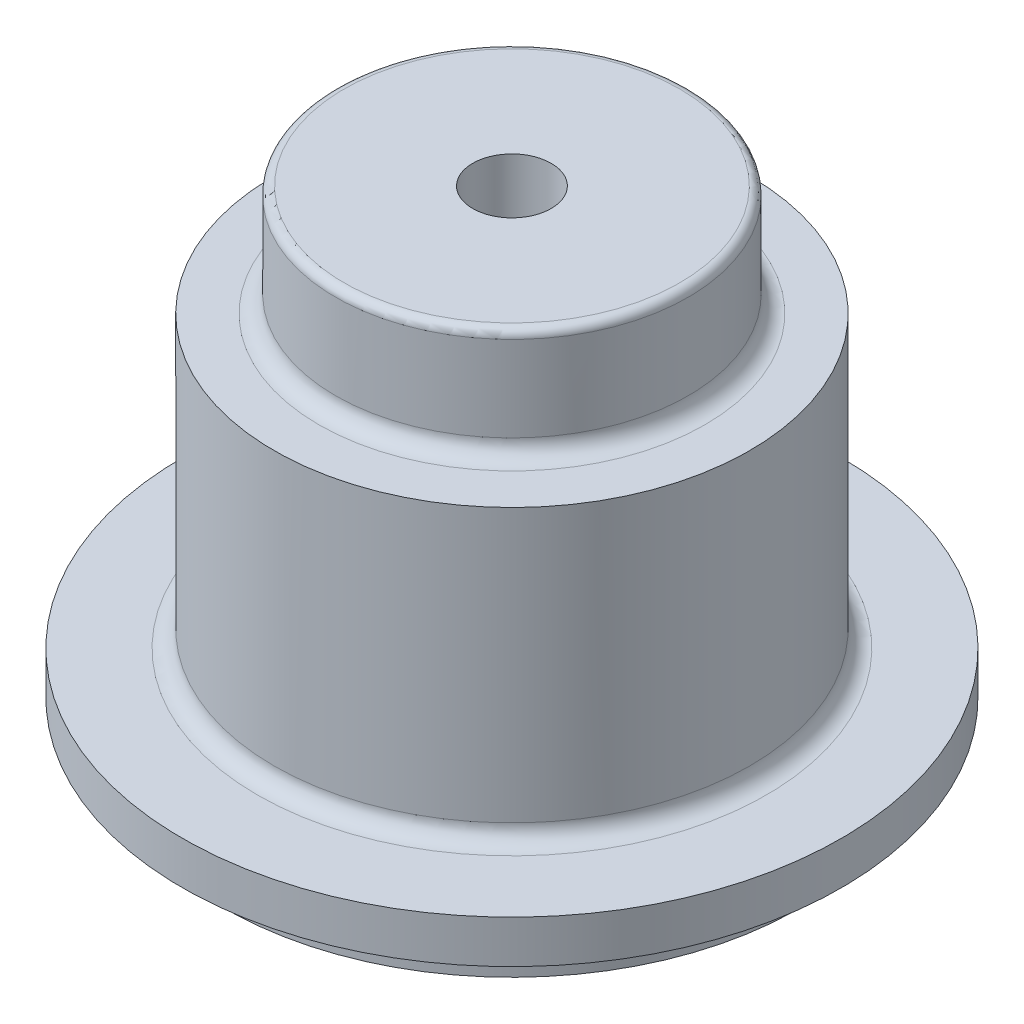
ISO-10303-21;
HEADER;
FILE_DESCRIPTION(('STEP AP214'),'2;1');
FILE_NAME('part.step','',(''),(''),'','','');
FILE_SCHEMA(('AUTOMOTIVE_DESIGN { 1 0 10303 214 1 1 1 1 }'));
ENDSEC;
DATA;
#1=APPLICATION_CONTEXT('core data for automotive mechanical design processes');
#2=APPLICATION_PROTOCOL_DEFINITION('international standard','automotive_design',2000,#1);
#3=PRODUCT_CONTEXT('',#1,'mechanical');
#4=PRODUCT('Part','Part','',(#3));
#5=PRODUCT_RELATED_PRODUCT_CATEGORY('part','',(#4));
#6=PRODUCT_DEFINITION_FORMATION('','',#4);
#7=PRODUCT_DEFINITION_CONTEXT('part definition',#1,'design');
#8=PRODUCT_DEFINITION('design','',#6,#7);
#9=PRODUCT_DEFINITION_SHAPE('','',#8);
#10=(LENGTH_UNIT() NAMED_UNIT(*) SI_UNIT(.MILLI.,.METRE.));
#11=(NAMED_UNIT(*) PLANE_ANGLE_UNIT() SI_UNIT($,.RADIAN.));
#12=(NAMED_UNIT(*) SI_UNIT($,.STERADIAN.) SOLID_ANGLE_UNIT());
#13=UNCERTAINTY_MEASURE_WITH_UNIT(LENGTH_MEASURE(1.E-05),#10,'distance_accuracy_value','');
#14=(GEOMETRIC_REPRESENTATION_CONTEXT(3) GLOBAL_UNCERTAINTY_ASSIGNED_CONTEXT((#13)) GLOBAL_UNIT_ASSIGNED_CONTEXT((#10,
#11,#12)) REPRESENTATION_CONTEXT('',''));
#15=CARTESIAN_POINT('',(0.,0.,0.));
#16=DIRECTION('',(0.,0.,1.));
#17=DIRECTION('',(1.,0.,0.));
#18=AXIS2_PLACEMENT_3D('',#15,#16,#17);
#19=CARTESIAN_POINT('',(0.,25.3,0.));
#20=DIRECTION('',(0.,1.,0.));
#21=DIRECTION('',(0.,0.,1.));
#22=AXIS2_PLACEMENT_3D('',#19,#20,#21);
#23=PLANE('',#22);
#24=CARTESIAN_POINT('',(0.,25.3,0.));
#25=DIRECTION('',(0.,-1.,0.));
#26=DIRECTION('',(0.,0.,-1.));
#27=AXIS2_PLACEMENT_3D('',#24,#25,#26);
#28=CIRCLE('',#27,12.3346398960364);
#29=CARTESIAN_POINT('',(0.,25.3,-12.3346398960364));
#30=VERTEX_POINT('',#29);
#31=EDGE_CURVE('E71',#30,#30,#28,.T.);
#32=ORIENTED_EDGE('',*,*,#31,.T.);
#33=EDGE_LOOP('',(#32));
#34=FACE_BOUND('',#33,.T.);
#35=ADVANCED_FACE('F39',(#34),#23,.F.);
#36=CARTESIAN_POINT('',(0.,0.,0.));
#37=DIRECTION('',(0.,-1.,0.));
#38=DIRECTION('',(0.,0.,-1.));
#39=AXIS2_PLACEMENT_3D('',#36,#37,#38);
#40=CYLINDRICAL_SURFACE('',#39,12.3346398960364);
#41=ORIENTED_EDGE('',*,*,#31,.F.);
#42=EDGE_LOOP('',(#41));
#43=FACE_BOUND('',#42,.T.);
#44=CARTESIAN_POINT('',(0.,0.,0.));
#45=DIRECTION('',(0.,-1.,0.));
#46=DIRECTION('',(0.,0.,-1.));
#47=AXIS2_PLACEMENT_3D('',#44,#45,#46);
#48=CIRCLE('',#47,12.3346398960364);
#49=CARTESIAN_POINT('',(0.,0.,-12.3346398960364));
#50=VERTEX_POINT('',#49);
#51=EDGE_CURVE('E75',#50,#50,#48,.T.);
#52=ORIENTED_EDGE('',*,*,#51,.T.);
#53=EDGE_LOOP('',(#52));
#54=FACE_BOUND('',#53,.T.);
#55=ADVANCED_FACE('F125',(#43,#54),#40,.F.);
#56=CARTESIAN_POINT('',(0.,0.,0.));
#57=DIRECTION('',(0.,-1.,0.));
#58=DIRECTION('',(0.,0.,-1.));
#59=AXIS2_PLACEMENT_3D('',#56,#57,#58);
#60=PLANE('',#59);
#61=CARTESIAN_POINT('',(0.,0.,0.));
#62=DIRECTION('',(0.,-1.,0.));
#63=DIRECTION('',(0.,0.,-1.));
#64=AXIS2_PLACEMENT_3D('',#61,#62,#63);
#65=CIRCLE('',#64,21.75);
#66=CARTESIAN_POINT('',(0.,0.,-21.75));
#67=VERTEX_POINT('',#66);
#68=EDGE_CURVE('E79',#67,#67,#65,.T.);
#69=ORIENTED_EDGE('',*,*,#68,.T.);
#70=EDGE_LOOP('',(#69));
#71=FACE_BOUND('',#70,.T.);
#72=ORIENTED_EDGE('',*,*,#51,.F.);
#73=EDGE_LOOP('',(#72));
#74=FACE_BOUND('',#73,.T.);
#75=ADVANCED_FACE('F131',(#71,#74),#60,.T.);
#76=CARTESIAN_POINT('',(0.,0.,0.));
#77=DIRECTION('',(0.,-1.,0.));
#78=DIRECTION('',(0.,0.,-1.));
#79=AXIS2_PLACEMENT_3D('',#76,#77,#78);
#80=CYLINDRICAL_SURFACE('',#79,21.75);
#81=CARTESIAN_POINT('',(0.,3.,0.));
#82=DIRECTION('',(0.,-1.,0.));
#83=DIRECTION('',(0.,0.,-1.));
#84=AXIS2_PLACEMENT_3D('',#81,#82,#83);
#85=CIRCLE('',#84,21.75);
#86=CARTESIAN_POINT('',(0.,3.,-21.75));
#87=VERTEX_POINT('',#86);
#88=EDGE_CURVE('E83',#87,#87,#85,.T.);
#89=ORIENTED_EDGE('',*,*,#88,.T.);
#90=EDGE_LOOP('',(#89));
#91=FACE_BOUND('',#90,.T.);
#92=ORIENTED_EDGE('',*,*,#68,.F.);
#93=EDGE_LOOP('',(#92));
#94=FACE_BOUND('',#93,.T.);
#95=ADVANCED_FACE('F171',(#91,#94),#80,.T.);
#96=CARTESIAN_POINT('',(0.,3.,0.));
#97=DIRECTION('',(0.,-1.,0.));
#98=DIRECTION('',(0.,0.,-1.));
#99=AXIS2_PLACEMENT_3D('',#96,#97,#98);
#100=PLANE('',#99);
#101=CARTESIAN_POINT('',(0.,3.,0.));
#102=DIRECTION('',(0.,-1.,0.));
#103=DIRECTION('',(0.,0.,-1.));
#104=AXIS2_PLACEMENT_3D('',#101,#102,#103);
#105=CIRCLE('',#104,25.);
#106=CARTESIAN_POINT('',(0.,3.,-25.));
#107=VERTEX_POINT('',#106);
#108=EDGE_CURVE('E87',#107,#107,#105,.T.);
#109=ORIENTED_EDGE('',*,*,#108,.T.);
#110=EDGE_LOOP('',(#109));
#111=FACE_BOUND('',#110,.T.);
#112=ORIENTED_EDGE('',*,*,#88,.F.);
#113=EDGE_LOOP('',(#112));
#114=FACE_BOUND('',#113,.T.);
#115=ADVANCED_FACE('F167',(#111,#114),#100,.T.);
#116=CARTESIAN_POINT('',(0.,0.,0.));
#117=DIRECTION('',(0.,-1.,0.));
#118=DIRECTION('',(0.,0.,-1.));
#119=AXIS2_PLACEMENT_3D('',#116,#117,#118);
#120=CYLINDRICAL_SURFACE('',#119,25.);
#121=CARTESIAN_POINT('',(0.,6.25,0.));
#122=DIRECTION('',(0.,-1.,0.));
#123=DIRECTION('',(0.,0.,-1.));
#124=AXIS2_PLACEMENT_3D('',#121,#122,#123);
#125=CIRCLE('',#124,25.);
#126=CARTESIAN_POINT('',(0.,6.25,-25.));
#127=VERTEX_POINT('',#126);
#128=EDGE_CURVE('E91',#127,#127,#125,.T.);
#129=ORIENTED_EDGE('',*,*,#128,.T.);
#130=EDGE_LOOP('',(#129));
#131=FACE_BOUND('',#130,.T.);
#132=ORIENTED_EDGE('',*,*,#108,.F.);
#133=EDGE_LOOP('',(#132));
#134=FACE_BOUND('',#133,.T.);
#135=ADVANCED_FACE('F160',(#131,#134),#120,.T.);
#136=CARTESIAN_POINT('',(0.,6.25,0.));
#137=DIRECTION('',(0.,1.,0.));
#138=DIRECTION('',(0.,0.,1.));
#139=AXIS2_PLACEMENT_3D('',#136,#137,#138);
#140=PLANE('',#139);
#141=CARTESIAN_POINT('',(0.,6.25,0.));
#142=DIRECTION('',(0.,1.,0.));
#143=DIRECTION('',(0.,0.,1.));
#144=AXIS2_PLACEMENT_3D('',#141,#142,#143);
#145=CIRCLE('',#144,19.3056104827136);
#146=CARTESIAN_POINT('',(0.,6.25,19.3056104827136));
#147=VERTEX_POINT('',#146);
#148=EDGE_CURVE('E67',#147,#147,#145,.F.);
#149=ORIENTED_EDGE('',*,*,#148,.T.);
#150=EDGE_LOOP('',(#149));
#151=FACE_BOUND('',#150,.T.);
#152=ORIENTED_EDGE('',*,*,#128,.F.);
#153=EDGE_LOOP('',(#152));
#154=FACE_BOUND('',#153,.T.);
#155=ADVANCED_FACE('F154',(#151,#154),#140,.T.);
#156=CARTESIAN_POINT('',(0.,0.,0.));
#157=DIRECTION('',(0.,-1.,0.));
#158=DIRECTION('',(0.,0.,-1.));
#159=AXIS2_PLACEMENT_3D('',#156,#157,#158);
#160=CYLINDRICAL_SURFACE('',#159,18.0356104827136);
#161=CARTESIAN_POINT('',(0.,7.52,0.));
#162=DIRECTION('',(0.,1.,0.));
#163=DIRECTION('',(0.,0.,1.));
#164=AXIS2_PLACEMENT_3D('',#161,#162,#163);
#165=CIRCLE('',#164,18.0356104827136);
#166=CARTESIAN_POINT('',(0.,7.52,18.0356104827136));
#167=VERTEX_POINT('',#166);
#168=EDGE_CURVE('E63',#167,#167,#165,.T.);
#169=ORIENTED_EDGE('',*,*,#168,.T.);
#170=EDGE_LOOP('',(#169));
#171=FACE_BOUND('',#170,.T.);
#172=CARTESIAN_POINT('',(0.,28.2358712803989,0.));
#173=DIRECTION('',(0.,-1.,0.));
#174=DIRECTION('',(0.,0.,-1.));
#175=AXIS2_PLACEMENT_3D('',#172,#173,#174);
#176=CIRCLE('',#175,18.0356104827136);
#177=CARTESIAN_POINT('',(0.,28.2358712803989,-18.0356104827136));
#178=VERTEX_POINT('',#177);
#179=EDGE_CURVE('E95',#178,#178,#176,.T.);
#180=ORIENTED_EDGE('',*,*,#179,.T.);
#181=EDGE_LOOP('',(#180));
#182=FACE_BOUND('',#181,.T.);
#183=ADVANCED_FACE('F149',(#171,#182),#160,.T.);
#184=CARTESIAN_POINT('',(0.,28.2358712803989,0.));
#185=DIRECTION('',(0.,1.,0.));
#186=DIRECTION('',(0.,0.,1.));
#187=AXIS2_PLACEMENT_3D('',#184,#185,#186);
#188=PLANE('',#187);
#189=CARTESIAN_POINT('',(0.,28.2358712803989,0.));
#190=DIRECTION('',(0.,1.,0.));
#191=DIRECTION('',(0.,0.,1.));
#192=AXIS2_PLACEMENT_3D('',#189,#190,#191);
#193=CIRCLE('',#192,14.640385965295);
#194=CARTESIAN_POINT('',(0.,28.2358712803989,14.640385965295));
#195=VERTEX_POINT('',#194);
#196=EDGE_CURVE('E57',#195,#195,#193,.F.);
#197=ORIENTED_EDGE('',*,*,#196,.T.);
#198=EDGE_LOOP('',(#197));
#199=FACE_BOUND('',#198,.T.);
#200=ORIENTED_EDGE('',*,*,#179,.F.);
#201=EDGE_LOOP('',(#200));
#202=FACE_BOUND('',#201,.T.);
#203=ADVANCED_FACE('F145',(#199,#202),#188,.T.);
#204=CARTESIAN_POINT('',(0.,0.,0.));
#205=DIRECTION('',(0.,-1.,0.));
#206=DIRECTION('',(0.,0.,-1.));
#207=AXIS2_PLACEMENT_3D('',#204,#205,#206);
#208=CYLINDRICAL_SURFACE('',#207,13.370385965295);
#209=CARTESIAN_POINT('',(0.,35.9760951977092,0.));
#210=DIRECTION('',(0.,-1.,0.));
#211=DIRECTION('',(0.,0.,-1.));
#212=AXIS2_PLACEMENT_3D('',#209,#210,#211);
#213=CIRCLE('',#212,13.370385965295);
#214=CARTESIAN_POINT('',(0.,35.9760951977092,-13.370385965295));
#215=VERTEX_POINT('',#214);
#216=EDGE_CURVE('E47',#215,#215,#213,.T.);
#217=ORIENTED_EDGE('',*,*,#216,.T.);
#218=EDGE_LOOP('',(#217));
#219=FACE_BOUND('',#218,.T.);
#220=CARTESIAN_POINT('',(0.,29.5058712803989,0.));
#221=DIRECTION('',(0.,1.,0.));
#222=DIRECTION('',(0.,0.,1.));
#223=AXIS2_PLACEMENT_3D('',#220,#221,#222);
#224=CIRCLE('',#223,13.370385965295);
#225=CARTESIAN_POINT('',(0.,29.5058712803989,13.370385965295));
#226=VERTEX_POINT('',#225);
#227=EDGE_CURVE('E52',#226,#226,#224,.T.);
#228=ORIENTED_EDGE('',*,*,#227,.T.);
#229=EDGE_LOOP('',(#228));
#230=FACE_BOUND('',#229,.T.);
#231=ADVANCED_FACE('F148',(#219,#230),#208,.T.);
#232=CARTESIAN_POINT('',(0.,36.6110951977091,0.));
#233=DIRECTION('',(0.,-1.,0.));
#234=DIRECTION('',(0.,0.,-1.));
#235=AXIS2_PLACEMENT_3D('',#232,#233,#234);
#236=PLANE('',#235);
#237=CARTESIAN_POINT('',(0.,36.6110951977091,0.));
#238=DIRECTION('',(0.,-1.,0.));
#239=DIRECTION('',(0.,0.,-1.));
#240=AXIS2_PLACEMENT_3D('',#237,#238,#239);
#241=CIRCLE('',#240,12.735385965295);
#242=CARTESIAN_POINT('',(0.,36.6110951977091,-12.735385965295));
#243=VERTEX_POINT('',#242);
#244=EDGE_CURVE('E10',#243,#243,#241,.F.);
#245=ORIENTED_EDGE('',*,*,#244,.T.);
#246=EDGE_LOOP('',(#245));
#247=FACE_BOUND('',#246,.T.);
#248=CARTESIAN_POINT('',(0.,36.6110951977091,0.));
#249=DIRECTION('',(0.,-1.,0.));
#250=DIRECTION('',(0.,0.,-1.));
#251=AXIS2_PLACEMENT_3D('',#248,#249,#250);
#252=CIRCLE('',#251,2.97474193372406);
#253=CARTESIAN_POINT('',(0.,36.6110951977091,-2.97474193372406));
#254=VERTEX_POINT('',#253);
#255=EDGE_CURVE('E99',#254,#254,#252,.T.);
#256=ORIENTED_EDGE('',*,*,#255,.T.);
#257=EDGE_LOOP('',(#256));
#258=FACE_BOUND('',#257,.T.);
#259=ADVANCED_FACE('F121',(#247,#258),#236,.F.);
#260=CARTESIAN_POINT('',(0.,0.,0.));
#261=DIRECTION('',(0.,-1.,0.));
#262=DIRECTION('',(0.,0.,-1.));
#263=AXIS2_PLACEMENT_3D('',#260,#261,#262);
#264=CYLINDRICAL_SURFACE('',#263,2.97474193372406);
#265=ORIENTED_EDGE('',*,*,#255,.F.);
#266=EDGE_LOOP('',(#265));
#267=FACE_BOUND('',#266,.T.);
#268=CARTESIAN_POINT('',(0.,28.2358712803989,0.));
#269=DIRECTION('',(0.,-1.,0.));
#270=DIRECTION('',(0.,0.,-1.));
#271=AXIS2_PLACEMENT_3D('',#268,#269,#270);
#272=CIRCLE('',#271,2.97474193372406);
#273=CARTESIAN_POINT('',(0.,28.2358712803989,-2.97474193372406));
#274=VERTEX_POINT('',#273);
#275=EDGE_CURVE('E103',#274,#274,#272,.T.);
#276=ORIENTED_EDGE('',*,*,#275,.T.);
#277=EDGE_LOOP('',(#276));
#278=FACE_BOUND('',#277,.T.);
#279=ADVANCED_FACE('F108',(#267,#278),#264,.F.);
#280=CARTESIAN_POINT('',(0.,28.2358712803989,0.));
#281=DIRECTION('',(0.,1.,0.));
#282=DIRECTION('',(0.,0.,1.));
#283=AXIS2_PLACEMENT_3D('',#280,#281,#282);
#284=PLANE('',#283);
#285=ORIENTED_EDGE('',*,*,#275,.F.);
#286=EDGE_LOOP('',(#285));
#287=FACE_BOUND('',#286,.T.);
#288=ADVANCED_FACE('F110',(#287),#284,.T.);
#289=CARTESIAN_POINT('',(0.,7.52,0.));
#290=DIRECTION('',(0.,1.,0.));
#291=DIRECTION('',(0.,0.,1.));
#292=AXIS2_PLACEMENT_3D('',#289,#290,#291);
#293=TOROIDAL_SURFACE('',#292,19.3056104827136,1.27);
#294=ORIENTED_EDGE('',*,*,#168,.F.);
#295=EDGE_LOOP('',(#294));
#296=FACE_BOUND('',#295,.T.);
#297=ORIENTED_EDGE('',*,*,#148,.F.);
#298=EDGE_LOOP('',(#297));
#299=FACE_BOUND('',#298,.T.);
#300=ADVANCED_FACE('F112',(#296,#299),#293,.F.);
#301=CARTESIAN_POINT('',(0.,29.5058712803989,0.));
#302=DIRECTION('',(0.,1.,0.));
#303=DIRECTION('',(0.,0.,1.));
#304=AXIS2_PLACEMENT_3D('',#301,#302,#303);
#305=TOROIDAL_SURFACE('',#304,14.640385965295,1.27);
#306=ORIENTED_EDGE('',*,*,#227,.F.);
#307=EDGE_LOOP('',(#306));
#308=FACE_BOUND('',#307,.T.);
#309=ORIENTED_EDGE('',*,*,#196,.F.);
#310=EDGE_LOOP('',(#309));
#311=FACE_BOUND('',#310,.T.);
#312=ADVANCED_FACE('F118',(#308,#311),#305,.F.);
#313=CARTESIAN_POINT('',(0.,35.9760951977092,0.));
#314=DIRECTION('',(0.,-1.,0.));
#315=DIRECTION('',(0.,0.,-1.));
#316=AXIS2_PLACEMENT_3D('',#313,#314,#315);
#317=TOROIDAL_SURFACE('',#316,12.735385965295,0.635);
#318=ORIENTED_EDGE('',*,*,#244,.F.);
#319=EDGE_LOOP('',(#318));
#320=FACE_BOUND('',#319,.T.);
#321=ORIENTED_EDGE('',*,*,#216,.F.);
#322=EDGE_LOOP('',(#321));
#323=FACE_BOUND('',#322,.T.);
#324=ADVANCED_FACE('F41',(#320,#323),#317,.T.);
#325=CLOSED_SHELL('',(#35,#55,#75,#95,#115,#135,#155,#183,#203,#231,#259,#279,#288,#300,#312,#324));
#326=MANIFOLD_SOLID_BREP('B2',#325);
#327=ADVANCED_BREP_SHAPE_REPRESENTATION('',(#18,#326),#14);
#328=SHAPE_DEFINITION_REPRESENTATION(#9,#327);
ENDSEC;
END-ISO-10303-21;
